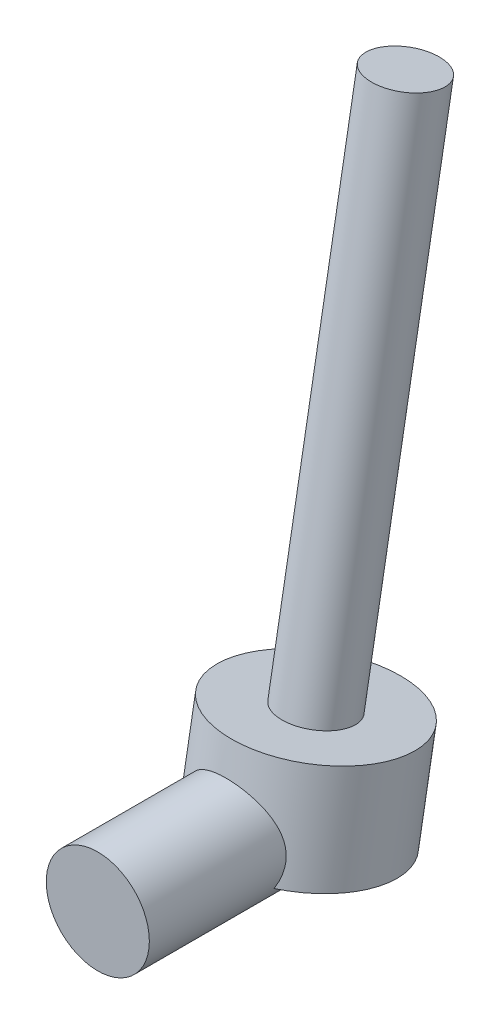
ISO-10303-21;
HEADER;
FILE_DESCRIPTION(('STEP AP214'),'2;1');
FILE_NAME('part.step','',(''),(''),'','','');
FILE_SCHEMA(('AUTOMOTIVE_DESIGN { 1 0 10303 214 1 1 1 1 }'));
ENDSEC;
DATA;
#1=APPLICATION_CONTEXT('core data for automotive mechanical design processes');
#2=APPLICATION_PROTOCOL_DEFINITION('international standard','automotive_design',2000,#1);
#3=PRODUCT_CONTEXT('',#1,'mechanical');
#4=PRODUCT('Part','Part','',(#3));
#5=PRODUCT_RELATED_PRODUCT_CATEGORY('part','',(#4));
#6=PRODUCT_DEFINITION_FORMATION('','',#4);
#7=PRODUCT_DEFINITION_CONTEXT('part definition',#1,'design');
#8=PRODUCT_DEFINITION('design','',#6,#7);
#9=PRODUCT_DEFINITION_SHAPE('','',#8);
#10=(LENGTH_UNIT() NAMED_UNIT(*) SI_UNIT(.MILLI.,.METRE.));
#11=(NAMED_UNIT(*) PLANE_ANGLE_UNIT() SI_UNIT($,.RADIAN.));
#12=(NAMED_UNIT(*) SI_UNIT($,.STERADIAN.) SOLID_ANGLE_UNIT());
#13=UNCERTAINTY_MEASURE_WITH_UNIT(LENGTH_MEASURE(1.E-05),#10,'distance_accuracy_value','');
#14=(GEOMETRIC_REPRESENTATION_CONTEXT(3) GLOBAL_UNCERTAINTY_ASSIGNED_CONTEXT((#13)) GLOBAL_UNIT_ASSIGNED_CONTEXT((#10,
#11,#12)) REPRESENTATION_CONTEXT('',''));
#15=CARTESIAN_POINT('',(0.,0.,0.));
#16=DIRECTION('',(0.,0.,1.));
#17=DIRECTION('',(1.,0.,0.));
#18=AXIS2_PLACEMENT_3D('',#15,#16,#17);
#19=CARTESIAN_POINT('',(0.,39.3923101204883,-6.94592710667723));
#20=DIRECTION('',(0.,0.984807753012208,-0.173648177666931));
#21=DIRECTION('',(0.,0.173648177666931,0.984807753012208));
#22=AXIS2_PLACEMENT_3D('',#19,#20,#21);
#23=PLANE('',#22);
#24=CARTESIAN_POINT('',(0.,39.3923101204883,-6.94592710667723));
#25=DIRECTION('',(0.,0.984807753012208,-0.173648177666931));
#26=DIRECTION('',(0.,0.173648177666931,0.984807753012208));
#27=AXIS2_PLACEMENT_3D('',#24,#25,#26);
#28=CIRCLE('',#27,50.);
#29=CARTESIAN_POINT('',(0.,48.0747190038349,42.2944605439332));
#30=VERTEX_POINT('',#29);
#31=EDGE_CURVE('E79',#30,#30,#28,.T.);
#32=ORIENTED_EDGE('',*,*,#31,.T.);
#33=EDGE_LOOP('',(#32));
#34=FACE_BOUND('',#33,.T.);
#35=CARTESIAN_POINT('',(0.,39.3923101204883,-6.94592710667723));
#36=DIRECTION('',(0.,0.984807753012208,-0.173648177666931));
#37=DIRECTION('',(0.,0.173648177666931,0.984807753012208));
#38=AXIS2_PLACEMENT_3D('',#35,#36,#37);
#39=CIRCLE('',#38,20.);
#40=CARTESIAN_POINT('',(0.,42.8652736738269,12.7502279535669));
#41=VERTEX_POINT('',#40);
#42=EDGE_CURVE('E83',#41,#41,#39,.T.);
#43=ORIENTED_EDGE('',*,*,#42,.F.);
#44=EDGE_LOOP('',(#43));
#45=FACE_BOUND('',#44,.T.);
#46=ADVANCED_FACE('F34',(#34,#45),#23,.T.);
#47=CARTESIAN_POINT('',(0.,0.,120.));
#48=DIRECTION('',(0.,0.,-1.));
#49=DIRECTION('',(-1.,0.,0.));
#50=AXIS2_PLACEMENT_3D('',#47,#48,#49);
#51=CYLINDRICAL_SURFACE('',#50,30.0000000000001);
#52=CARTESIAN_POINT('',(0.,0.,120.));
#53=DIRECTION('',(0.,0.,1.));
#54=DIRECTION('',(1.,0.,0.));
#55=AXIS2_PLACEMENT_3D('',#52,#53,#54);
#56=CIRCLE('',#55,30.0000000000001);
#57=CARTESIAN_POINT('',(30.0000000000001,0.,120.));
#58=VERTEX_POINT('',#57);
#59=EDGE_CURVE('E66',#58,#58,#56,.T.);
#60=ORIENTED_EDGE('',*,*,#59,.F.);
#61=EDGE_LOOP('',(#60));
#62=FACE_BOUND('',#61,.T.);
#63=CARTESIAN_POINT('',(0.,0.,115.175409662872));
#64=DIRECTION('',(0.,0.984807753012208,-0.173648177666931));
#65=DIRECTION('',(0.,-0.173648177666931,-0.984807753012208));
#66=AXIS2_PLACEMENT_3D('',#63,#64,#65);
#67=ELLIPSE('',#66,172.763114494309,30.0000000000001);
#68=CARTESIAN_POINT('',(-22.0808405263409,-20.3085322377149,0.));
#69=VERTEX_POINT('',#68);
#70=CARTESIAN_POINT('',(-27.3069645861699,-12.4229499350865,44.7213595499958));
#71=VERTEX_POINT('',#70);
#72=EDGE_CURVE('E67',#69,#71,#67,.T.);
#73=ORIENTED_EDGE('',*,*,#72,.F.);
#74=CARTESIAN_POINT('',(0.,0.,0.));
#75=DIRECTION('',(0.,0.,1.));
#76=DIRECTION('',(1.,0.,0.));
#77=AXIS2_PLACEMENT_3D('',#74,#75,#76);
#78=CIRCLE('',#77,30.0000000000001);
#79=CARTESIAN_POINT('',(22.0808405263409,-20.3085322377149,0.));
#80=VERTEX_POINT('',#79);
#81=EDGE_CURVE('E63',#69,#80,#78,.T.);
#82=ORIENTED_EDGE('',*,*,#81,.T.);
#83=CARTESIAN_POINT('',(27.3069645861699,-12.4229499350865,44.7213595499958));
#84=VERTEX_POINT('',#83);
#85=EDGE_CURVE('E56',#84,#80,#67,.T.);
#86=ORIENTED_EDGE('',*,*,#85,.F.);
#87=CARTESIAN_POINT('',(-30.0000000000001,0.,40.6170644754298));
#88=CARTESIAN_POINT('',(-29.9999933128639,-0.812062526331669,40.7602641721619));
#89=CARTESIAN_POINT('',(-29.9669582353856,-1.62019902701734,40.9279778715198));
#90=CARTESIAN_POINT('',(-29.8374086625296,-3.22105098571032,41.3084035420969));
#91=CARTESIAN_POINT('',(-29.7408359039973,-4.01375160166262,41.5211566922943));
#92=CARTESIAN_POINT('',(-29.4871301619312,-5.58041554511572,41.9867724316947));
#93=CARTESIAN_POINT('',(-29.3297846839355,-6.35430288463254,42.2397739047022));
#94=CARTESIAN_POINT('',(-28.9582362666195,-7.87617896265546,42.7787555566446));
#95=CARTESIAN_POINT('',(-28.7440441520663,-8.6241726012322,43.064729451096));
#96=CARTESIAN_POINT('',(-28.2647985013294,-10.0838985550322,43.6597671414494));
#97=CARTESIAN_POINT('',(-28.0003146277656,-10.7959335654061,43.968550648185));
#98=CARTESIAN_POINT('',(-27.4218971191035,-12.1905503999319,44.6055312517651));
#99=CARTESIAN_POINT('',(-27.1079622989726,-12.8731315177569,44.9337288137265));
#100=CARTESIAN_POINT('',(-26.4330713482872,-14.2074466893695,45.6034345984411));
#101=CARTESIAN_POINT('',(-26.0721302221256,-14.8591904962952,45.9449385495268));
#102=CARTESIAN_POINT('',(-25.3049268851677,-16.1310983536255,46.635739105894));
#103=CARTESIAN_POINT('',(-24.8986617565506,-16.7512603671431,46.9850362117157));
#104=CARTESIAN_POINT('',(-23.9641164742025,-18.0689503566791,47.749947259522));
#105=CARTESIAN_POINT('',(-23.4270878220144,-18.7600103271928,48.1660581391226));
#106=CARTESIAN_POINT('',(-22.29307678325,-20.094417329395,48.9933177868895));
#107=CARTESIAN_POINT('',(-21.6960847052574,-20.7377566190603,49.4044657408697));
#108=CARTESIAN_POINT('',(-20.4433832759216,-21.9736615079953,50.2134489200501));
#109=CARTESIAN_POINT('',(-19.7876864433567,-22.5662378799548,50.6112869588472));
#110=CARTESIAN_POINT('',(-18.7613230765646,-23.4138758063615,51.1916304628025));
#111=CARTESIAN_POINT('',(-18.4120877817722,-23.6895354133388,51.3823317837952));
#112=CARTESIAN_POINT('',(-17.6993628623214,-24.2266740819512,51.7573015985376));
#113=CARTESIAN_POINT('',(-17.3358696559105,-24.488149540541,51.9415684536139));
#114=CARTESIAN_POINT('',(-16.3597965313795,-25.1574270588965,52.4170848191628));
#115=CARTESIAN_POINT('',(-15.7355115257763,-25.5528044692409,52.7020298225707));
#116=CARTESIAN_POINT('',(-14.4513080246667,-26.3004107199458,53.2467535472091));
#117=CARTESIAN_POINT('',(-13.7913968512878,-26.6526483783996,53.5065374092894));
#118=CARTESIAN_POINT('',(-12.4383054266619,-27.3103270652144,53.9959581435473));
#119=CARTESIAN_POINT('',(-11.7451438777392,-27.6157940045881,54.2256116977705));
#120=CARTESIAN_POINT('',(-10.3283198490529,-28.1763398415174,54.6500467421092));
#121=CARTESIAN_POINT('',(-9.60465710123482,-28.4314182961307,54.8448279256761));
#122=CARTESIAN_POINT('',(-8.12453669941178,-28.8893958238056,55.1964316610007));
#123=CARTESIAN_POINT('',(-7.36784555439011,-29.0918133148294,55.3529031574067));
#124=CARTESIAN_POINT('',(-5.83334086861444,-29.4379114156501,55.6214401433393));
#125=CARTESIAN_POINT('',(-5.05552723780512,-29.5815917749803,55.7335054435093));
#126=CARTESIAN_POINT('',(-3.48621211622042,-29.8072850388867,55.9099046378875));
#127=CARTESIAN_POINT('',(-2.69472128179107,-29.8893439184797,55.9742741168754));
#128=CARTESIAN_POINT('',(-1.10529531300237,-29.9902007854569,56.053425468405));
#129=CARTESIAN_POINT('',(-0.307361124022591,-30.0090078900723,56.0682144875675));
#130=CARTESIAN_POINT('',(1.17553105713215,-29.9848128821419,56.04921116557));
#131=CARTESIAN_POINT('',(1.86072896033308,-29.9500631745498,56.0219049902959));
#132=CARTESIAN_POINT('',(3.22467234875124,-29.8340375007308,55.9309198702979));
#133=CARTESIAN_POINT('',(3.90341853832262,-29.7527666740742,55.8672449435305));
#134=CARTESIAN_POINT('',(5.24971840815577,-29.5449574318335,55.7049484484786));
#135=CARTESIAN_POINT('',(5.91727116812717,-29.4184153130978,55.6063240213622));
#136=CARTESIAN_POINT('',(7.23687046798545,-29.1219003490343,55.3762371655985));
#137=CARTESIAN_POINT('',(7.88891636817715,-28.9519257153963,55.2447733848135));
#138=CARTESIAN_POINT('',(9.17077780935253,-28.5716941646634,54.9523297408575));
#139=CARTESIAN_POINT('',(9.80068430737698,-28.3616326184684,54.7914931884184));
#140=CARTESIAN_POINT('',(11.0386006677266,-27.9031361247253,54.4428163347552));
#141=CARTESIAN_POINT('',(11.6466109039995,-27.6547018328964,54.2549764949711));
#142=CARTESIAN_POINT('',(12.8385633729406,-27.1219012077969,53.8553730755297));
#143=CARTESIAN_POINT('',(13.42250330374,-26.8375314485028,53.6436072150123));
#144=CARTESIAN_POINT('',(14.5646446269245,-26.2352445362992,53.199315272744));
#145=CARTESIAN_POINT('',(15.122842567895,-25.9173229035305,52.96678641935));
#146=CARTESIAN_POINT('',(16.2979235331963,-25.1976997894168,52.4461744774358));
#147=CARTESIAN_POINT('',(16.9102327030718,-24.7906852442953,52.1551052382952));
#148=CARTESIAN_POINT('',(18.0974014798377,-23.9378028190275,51.5542025774292));
#149=CARTESIAN_POINT('',(18.6722579070329,-23.4919316474905,51.2443675668091));
#150=CARTESIAN_POINT('',(19.7841517636277,-22.5635192319928,50.6103080775354));
#151=CARTESIAN_POINT('',(20.3211530635159,-22.0809438460843,50.2860703211011));
#152=CARTESIAN_POINT('',(21.3560749414913,-21.0816402496948,49.6280464549177));
#153=CARTESIAN_POINT('',(21.8539934207117,-20.5649102077456,49.294259833677));
#154=CARTESIAN_POINT('',(22.9096254207287,-19.3880702256562,48.5516475080206));
#155=CARTESIAN_POINT('',(23.4582282184282,-18.7204960618567,48.1416572811604));
#156=CARTESIAN_POINT('',(24.4961796785788,-17.3402133500998,47.3223106326719));
#157=CARTESIAN_POINT('',(24.9855172647321,-16.6274964030286,46.9129543435922));
#158=CARTESIAN_POINT('',(25.9029333673188,-15.1587520744083,46.1032756879028));
#159=CARTESIAN_POINT('',(26.3310117301662,-14.4027245842798,45.7029533439446));
#160=CARTESIAN_POINT('',(27.123105166142,-12.8490164047014,44.9202759921266));
#161=CARTESIAN_POINT('',(27.4871339262316,-12.0513446617018,44.5379171584197));
#162=CARTESIAN_POINT('',(28.0905106716526,-10.5572502064451,43.8642587863411));
#163=CARTESIAN_POINT('',(28.3405340272071,-9.86708446398169,43.5686259638145));
#164=CARTESIAN_POINT('',(28.7915781398627,-8.46108400296919,43.0018891998231));
#165=CARTESIAN_POINT('',(28.9926033064956,-7.74525160091533,42.7307830524921));
#166=CARTESIAN_POINT('',(29.3424586496842,-6.29114920553117,42.2192387887645));
#167=CARTESIAN_POINT('',(29.4913507825795,-5.55290698683436,41.9787644864532));
#168=CARTESIAN_POINT('',(29.7341140900452,-4.05668773033524,41.5337518235636));
#169=CARTESIAN_POINT('',(29.8279857477182,-3.29871086587231,41.3292131474667));
#170=CARTESIAN_POINT('',(29.9583027827371,-1.7609086655617,40.959367496533));
#171=CARTESIAN_POINT('',(29.9942173222625,-0.980947210669066,40.7944348204434));
#172=CARTESIAN_POINT('',(30.0044939175363,0.58769210528176,40.5100170824985));
#173=CARTESIAN_POINT('',(29.9788567524476,1.37636985587743,40.3905314453663));
#174=CARTESIAN_POINT('',(29.8646224613053,2.95468032489551,40.1988754518816));
#175=CARTESIAN_POINT('',(29.7760453821084,3.74431265935192,40.1266900441028));
#176=CARTESIAN_POINT('',(29.5358119192363,5.31679011494445,40.0291250292881));
#177=CARTESIAN_POINT('',(29.3841607125408,6.09963578773215,40.0037415817835));
#178=CARTESIAN_POINT('',(29.0433855305199,7.54708844619295,39.9974750222571));
#179=CARTESIAN_POINT('',(28.8619786906774,8.21351452379334,40.0110978200718));
#180=CARTESIAN_POINT('',(28.4540944150518,9.53099910027984,40.0684852428822));
#181=CARTESIAN_POINT('',(28.2276218142714,10.1820592393676,40.1122466356152));
#182=CARTESIAN_POINT('',(27.7312502469898,11.465218597678,40.2263115343899));
#183=CARTESIAN_POINT('',(27.4613359006864,12.0973110073231,40.2966244524546));
#184=CARTESIAN_POINT('',(26.8800605186996,13.3391320459665,40.4597409492939));
#185=CARTESIAN_POINT('',(26.5686963423389,13.9488589758497,40.5525462327655));
#186=CARTESIAN_POINT('',(25.8834889497873,15.1848073110882,40.7635222236443));
#187=CARTESIAN_POINT('',(25.5068073151428,15.809229621875,40.8830076150282));
#188=CARTESIAN_POINT('',(24.7106929699616,17.0267668624657,41.1377630761313));
#189=CARTESIAN_POINT('',(24.2912592159803,17.6198810276,41.2730335311259));
#190=CARTESIAN_POINT('',(23.4117230070641,18.7727760217071,41.5544949675483));
#191=CARTESIAN_POINT('',(22.9516039712766,19.332543103438,41.700690397539));
#192=CARTESIAN_POINT('',(21.9930026695657,20.4164485052885,41.9993075434392));
#193=CARTESIAN_POINT('',(21.4945177592334,20.9405843647906,42.1517296881914));
#194=CARTESIAN_POINT('',(20.3826638599702,22.0281685009467,42.4817886281328));
#195=CARTESIAN_POINT('',(19.7633539718624,22.5854679595675,42.6597339063721));
#196=CARTESIAN_POINT('',(18.4798777370462,23.6471528667697,43.0119519382834));
#197=CARTESIAN_POINT('',(17.8157073772844,24.1515335711007,43.1862243615606));
#198=CARTESIAN_POINT('',(16.4458629045404,25.1043777678162,43.525486227071));
#199=CARTESIAN_POINT('',(15.7401785844795,25.5528274230992,43.6904733666466));
#200=CARTESIAN_POINT('',(14.2913738075836,26.3904672444967,44.0059657743482));
#201=CARTESIAN_POINT('',(13.5482540373269,26.7796584969034,44.1564713079244));
#202=CARTESIAN_POINT('',(12.0119866837051,27.503621089793,44.4415391903655));
#203=CARTESIAN_POINT('',(11.218091950072,27.8369807364013,44.575669712769));
#204=CARTESIAN_POINT('',(9.60121177642963,28.4351846061671,44.8196629360193));
#205=CARTESIAN_POINT('',(8.77822553783655,28.7000269468101,44.9295249700767));
#206=CARTESIAN_POINT('',(7.10983284511737,29.1581583087897,45.1213626435361));
#207=CARTESIAN_POINT('',(6.26443846308332,29.3514850510821,45.2033529820296));
#208=CARTESIAN_POINT('',(4.55776448129139,29.6644443532649,45.3368219872931));
#209=CARTESIAN_POINT('',(3.69648623778511,29.7840831753048,45.3883032467727));
#210=CARTESIAN_POINT('',(2.03161179908327,29.9419017406725,45.4563541972132));
#211=CARTESIAN_POINT('',(1.22863074094847,29.9856021811255,45.4752887332347));
#212=CARTESIAN_POINT('',(-0.378397469265683,30.0083733780368,45.485145575718));
#213=CARTESIAN_POINT('',(-1.18244456190347,29.9874475980722,45.4760693833864));
#214=CARTESIAN_POINT('',(-2.78535987081203,29.8812130516591,45.4301684468116));
#215=CARTESIAN_POINT('',(-3.5842287148739,29.79591224282,45.3933471322352));
#216=CARTESIAN_POINT('',(-5.17090734322089,29.5618807805435,45.2930105082815));
#217=CARTESIAN_POINT('',(-5.95871713749951,29.4131501844282,45.2294952230278));
#218=CARTESIAN_POINT('',(-7.49227809369679,29.0596759540707,45.0800373193595));
#219=CARTESIAN_POINT('',(-8.23856421380771,28.8569085694151,44.9948901634684));
#220=CARTESIAN_POINT('',(-9.71077904838647,28.3953496957011,44.8035162476566));
#221=CARTESIAN_POINT('',(-10.4367083881151,28.1365599295101,44.6972901359895));
#222=CARTESIAN_POINT('',(-11.8640791646953,27.5650996024291,44.466480519015));
#223=CARTESIAN_POINT('',(-12.5655180256766,27.2524233942553,44.3418950898548));
#224=CARTESIAN_POINT('',(-13.9401086592764,26.5755596075725,44.0775585983078));
#225=CARTESIAN_POINT('',(-14.61325910602,26.2113696181033,43.9378068261735));
#226=CARTESIAN_POINT('',(-15.96489853074,25.4120564160024,43.638537612771));
#227=CARTESIAN_POINT('',(-16.6415630209159,24.9740977079179,43.4783508304347));
#228=CARTESIAN_POINT('',(-17.9561760373519,24.0462700187942,43.1497115452271));
#229=CARTESIAN_POINT('',(-18.5941232911937,23.5563993331506,42.9812587710278));
#230=CARTESIAN_POINT('',(-19.8286117140494,22.5271490880326,42.6410633369411));
#231=CARTESIAN_POINT('',(-20.4251229237939,21.9877343481028,42.469318408901));
#232=CARTESIAN_POINT('',(-21.5732942845708,20.8623876120136,42.1282054080964));
#233=CARTESIAN_POINT('',(-22.1249526835385,20.2764538004664,41.9588374283951));
#234=CARTESIAN_POINT('',(-23.2167929650018,19.0189550205013,41.6171296312457));
#235=CARTESIAN_POINT('',(-23.7535799736307,18.3442724549391,41.4453856596813));
#236=CARTESIAN_POINT('',(-24.7689286721438,16.9483068602689,41.1193949391311));
#237=CARTESIAN_POINT('',(-25.2474856001811,16.2270200274055,40.965149621192));
#238=CARTESIAN_POINT('',(-26.1423778691305,14.742027950317,40.6826365184473));
#239=CARTESIAN_POINT('',(-26.5587218363988,13.9783286071276,40.5543651312577));
#240=CARTESIAN_POINT('',(-27.3251262702257,12.4135435003702,40.3324975416543));
#241=CARTESIAN_POINT('',(-27.6751984875486,11.6124643961335,40.2388951891905));
#242=CARTESIAN_POINT('',(-28.2847983820443,10.031978998847,40.0993950990214));
#243=CARTESIAN_POINT('',(-28.5487074069929,9.25450320737606,40.0508116963729));
#244=CARTESIAN_POINT('',(-29.0122143060488,7.67890434954211,39.9973352031478));
#245=CARTESIAN_POINT('',(-29.2118042198431,6.88077874069487,39.9924475184751));
#246=CARTESIAN_POINT('',(-29.5440270102873,5.27456175783919,40.0307141190261));
#247=CARTESIAN_POINT('',(-29.6768758277181,4.46651130402636,40.07371199878));
#248=CARTESIAN_POINT('',(-29.8757443664185,2.84686200762291,40.2096064712994));
#249=CARTESIAN_POINT('',(-29.9418207574016,2.03526676209474,40.3024606483805));
#250=CARTESIAN_POINT('',(-29.9833050753677,1.0215469442319,40.449646779992));
#251=CARTESIAN_POINT('',(-29.9895725939243,0.816914978108878,40.4809596889526));
#252=CARTESIAN_POINT('',(-29.9979204618281,0.408106201649915,40.5466883380299));
#253=CARTESIAN_POINT('',(-30.000001679308,0.203929305718354,40.5811034332849));
#254=CARTESIAN_POINT('',(-30.0000000000001,0.,40.6170644754298));
#255=B_SPLINE_CURVE_WITH_KNOTS('',3,(#87,#88,#89,#90,#91,#92,#93,#94,#95,#96,#97,#98,#99,#100,
#101,#102,#103,#104,#105,#106,#107,#108,#109,#110,#111,#112,#113,#114,#115,#116,#117,#118,#119,
#120,#121,#122,#123,#124,#125,#126,#127,#128,#129,#130,#131,#132,#133,#134,#135,#136,#137,#138,
#139,#140,#141,#142,#143,#144,#145,#146,#147,#148,#149,#150,#151,#152,#153,#154,#155,#156,#157,
#158,#159,#160,#161,#162,#163,#164,#165,#166,#167,#168,#169,#170,#171,#172,#173,#174,#175,#176,
#177,#178,#179,#180,#181,#182,#183,#184,#185,#186,#187,#188,#189,#190,#191,#192,#193,#194,#195,
#196,#197,#198,#199,#200,#201,#202,#203,#204,#205,#206,#207,#208,#209,#210,#211,#212,#213,#214,
#215,#216,#217,#218,#219,#220,#221,#222,#223,#224,#225,#226,#227,#228,#229,#230,#231,#232,#233,
#234,#235,#236,#237,#238,#239,#240,#241,#242,#243,#244,#245,#246,#247,#248,#249,#250,#251,#252,
#253,#254),.UNSPECIFIED.,.T.,.F.,(4,2,2,2,2,2,2,2,2,2,2,2,2,2,2,2,2,2,2,2,2,2,2,2,2,2,2,2,2,2,2,
2,2,2,2,2,2,2,2,2,2,2,2,2,2,2,2,2,2,2,2,2,2,2,2,2,2,2,2,2,2,2,2,2,2,2,2,2,2,2,2,2,2,2,2,2,2,2,2,
2,2,2,2,4),(0.,2.47350954802721,4.94929043651619,7.43380753418738,9.91785186779797,
12.3752755976039,14.8327582255881,17.2894583400366,19.7463167007056,22.6504286458326,
25.5550107172817,28.4589748557846,29.9107831719591,31.3629585647548,33.7365502645121,
36.1096559714388,38.481442181699,40.8532492403278,43.2460390990563,45.6388391610024,
48.0298522061303,50.4205205913191,52.4778593704333,54.5349709022891,56.5922507425298,
58.6496153038022,60.697197808035,62.7447453267494,64.7924882024836,66.840504840387,
69.2105582385177,71.5808125899793,73.9532993499002,76.3259134325641,79.1921302106986,
82.0588818429172,84.9256406623867,87.7917861291347,90.1637405960218,92.5354815229065,
94.9043941632776,97.2732860033057,99.6637541938558,102.054192124415,104.443869022814,
106.833349820701,108.903474758057,110.973377716066,113.044015106102,115.11480947891,
117.329533984071,119.544312556629,121.759997935714,123.975836170288,126.528752512184,
129.081897531868,131.635672941014,134.189401530127,136.800241475905,139.411153146949,
142.020685720441,144.629996499928,147.040139677868,149.450153688864,151.859869838879,
154.269583811214,156.601028706755,158.932401913093,161.264019595428,163.595746438816,
166.058463531872,168.521261516849,170.985822019326,173.45047874759,176.084535901077,
178.718808313742,181.352715122512,183.986154470156,186.449875434456,188.913901198744,
191.369902420329,193.823817480293,194.445106734582,195.06626713598),.UNSPECIFIED.);
#256=EDGE_CURVE('E11',#84,#71,#255,.T.);
#257=ORIENTED_EDGE('',*,*,#256,.T.);
#258=EDGE_LOOP('',(#73,#82,#86,#257));
#259=FACE_BOUND('',#258,.T.);
#260=ADVANCED_FACE('F36',(#62,#259),#51,.T.);
#261=CARTESIAN_POINT('',(0.,0.,0.));
#262=DIRECTION('',(0.,0.,1.));
#263=DIRECTION('',(1.,0.,0.));
#264=AXIS2_PLACEMENT_3D('',#261,#262,#263);
#265=PLANE('',#264);
#266=DIRECTION('',(-1.,0.,0.));
#267=VECTOR('',#266,1.);
#268=CARTESIAN_POINT('',(0.,-20.3085322377149,0.));
#269=LINE('',#268,#267);
#270=EDGE_CURVE('E46',#80,#69,#269,.T.);
#271=ORIENTED_EDGE('',*,*,#270,.F.);
#272=ORIENTED_EDGE('',*,*,#81,.F.);
#273=EDGE_LOOP('',(#271,#272));
#274=FACE_BOUND('',#273,.T.);
#275=ADVANCED_FACE('F64',(#274),#265,.F.);
#276=CARTESIAN_POINT('',(0.,0.,120.));
#277=DIRECTION('',(0.,0.,1.));
#278=DIRECTION('',(1.,0.,0.));
#279=AXIS2_PLACEMENT_3D('',#276,#277,#278);
#280=PLANE('',#279);
#281=ORIENTED_EDGE('',*,*,#59,.T.);
#282=EDGE_LOOP('',(#281));
#283=FACE_BOUND('',#282,.T.);
#284=ADVANCED_FACE('F111',(#283),#280,.T.);
#285=CARTESIAN_POINT('',(0.,-19.6961550602442,3.47296355333861));
#286=DIRECTION('',(0.,0.984807753012208,-0.173648177666931));
#287=DIRECTION('',(0.,0.173648177666931,0.984807753012208));
#288=AXIS2_PLACEMENT_3D('',#285,#286,#287);
#289=CYLINDRICAL_SURFACE('',#288,50.);
#290=ORIENTED_EDGE('',*,*,#31,.F.);
#291=EDGE_LOOP('',(#290));
#292=FACE_BOUND('',#291,.T.);
#293=ORIENTED_EDGE('',*,*,#256,.F.);
#294=CARTESIAN_POINT('',(0.,-19.6961550602442,3.47296355333861));
#295=DIRECTION('',(0.,0.984807753012208,-0.173648177666931));
#296=DIRECTION('',(0.,0.173648177666931,0.984807753012208));
#297=AXIS2_PLACEMENT_3D('',#294,#295,#296);
#298=CIRCLE('',#297,50.);
#299=EDGE_CURVE('E77',#84,#71,#298,.T.);
#300=ORIENTED_EDGE('',*,*,#299,.T.);
#301=EDGE_LOOP('',(#293,#300));
#302=FACE_BOUND('',#301,.T.);
#303=ADVANCED_FACE('F107',(#292,#302),#289,.T.);
#304=CARTESIAN_POINT('',(0.,-19.6961550602442,3.47296355333861));
#305=DIRECTION('',(0.,0.984807753012208,-0.173648177666931));
#306=DIRECTION('',(0.,0.173648177666931,0.984807753012208));
#307=AXIS2_PLACEMENT_3D('',#304,#305,#306);
#308=PLANE('',#307);
#309=ORIENTED_EDGE('',*,*,#270,.T.);
#310=ORIENTED_EDGE('',*,*,#72,.T.);
#311=ORIENTED_EDGE('',*,*,#299,.F.);
#312=ORIENTED_EDGE('',*,*,#85,.T.);
#313=EDGE_LOOP('',(#309,#310,#311,#312));
#314=FACE_BOUND('',#313,.T.);
#315=ADVANCED_FACE('F73',(#314),#308,.F.);
#316=CARTESIAN_POINT('',(0.,334.834636024151,-59.0403804067564));
#317=DIRECTION('',(0.,-0.984807753012208,0.173648177666931));
#318=DIRECTION('',(0.,-0.173648177666931,-0.984807753012208));
#319=AXIS2_PLACEMENT_3D('',#316,#317,#318);
#320=CYLINDRICAL_SURFACE('',#319,20.);
#321=CARTESIAN_POINT('',(0.,334.834636024151,-59.0403804067564));
#322=DIRECTION('',(0.,0.984807753012208,-0.173648177666931));
#323=DIRECTION('',(0.,0.173648177666931,0.984807753012208));
#324=AXIS2_PLACEMENT_3D('',#321,#322,#323);
#325=CIRCLE('',#324,20.);
#326=CARTESIAN_POINT('',(0.,338.307599577489,-39.3442253465123));
#327=VERTEX_POINT('',#326);
#328=EDGE_CURVE('E82',#327,#327,#325,.T.);
#329=ORIENTED_EDGE('',*,*,#328,.F.);
#330=EDGE_LOOP('',(#329));
#331=FACE_BOUND('',#330,.T.);
#332=ORIENTED_EDGE('',*,*,#42,.T.);
#333=EDGE_LOOP('',(#332));
#334=FACE_BOUND('',#333,.T.);
#335=ADVANCED_FACE('F91',(#331,#334),#320,.T.);
#336=CARTESIAN_POINT('',(0.,334.834636024151,-59.0403804067564));
#337=DIRECTION('',(0.,0.984807753012208,-0.173648177666931));
#338=DIRECTION('',(0.,0.173648177666931,0.984807753012208));
#339=AXIS2_PLACEMENT_3D('',#336,#337,#338);
#340=PLANE('',#339);
#341=ORIENTED_EDGE('',*,*,#328,.T.);
#342=EDGE_LOOP('',(#341));
#343=FACE_BOUND('',#342,.T.);
#344=ADVANCED_FACE('F89',(#343),#340,.T.);
#345=CLOSED_SHELL('',(#46,#260,#275,#284,#303,#315,#335,#344));
#346=MANIFOLD_SOLID_BREP('B2',#345);
#347=ADVANCED_BREP_SHAPE_REPRESENTATION('',(#18,#346),#14);
#348=SHAPE_DEFINITION_REPRESENTATION(#9,#347);
ENDSEC;
END-ISO-10303-21;
